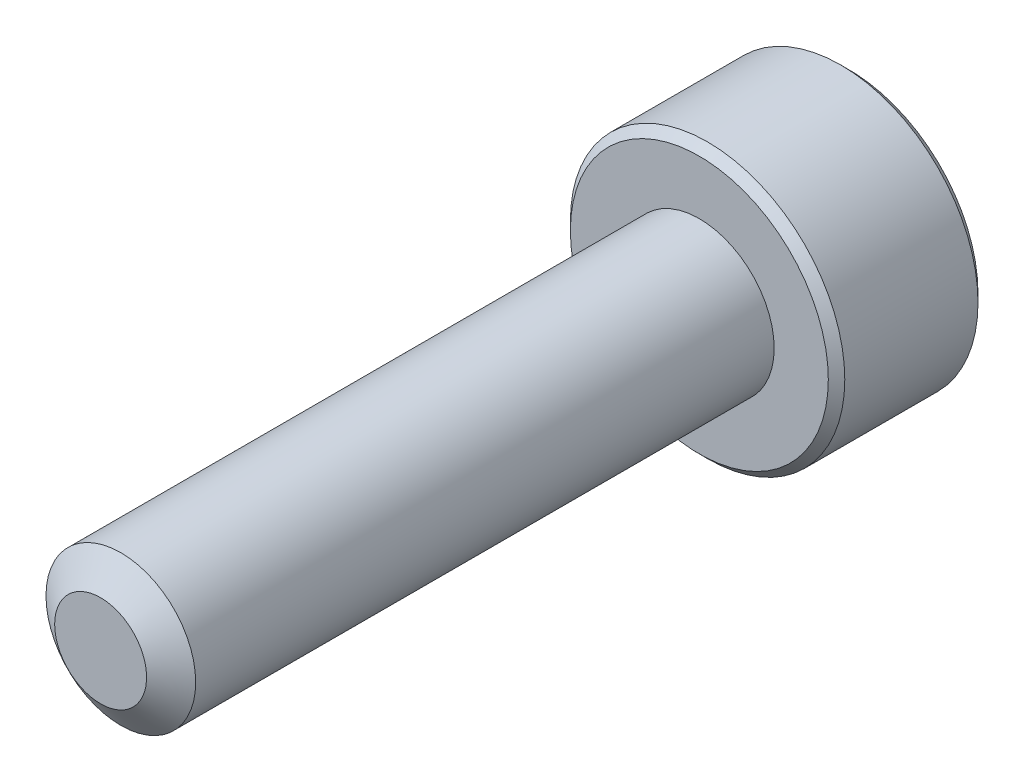
ISO-10303-21;
HEADER;
FILE_DESCRIPTION(('STEP AP214'),'2;1');
FILE_NAME('part.step','',(''),(''),'','','');
FILE_SCHEMA(('AUTOMOTIVE_DESIGN { 1 0 10303 214 1 1 1 1 }'));
ENDSEC;
DATA;
#1=APPLICATION_CONTEXT('core data for automotive mechanical design processes');
#2=APPLICATION_PROTOCOL_DEFINITION('international standard','automotive_design',2000,#1);
#3=PRODUCT_CONTEXT('',#1,'mechanical');
#4=PRODUCT('Part','Part','',(#3));
#5=PRODUCT_RELATED_PRODUCT_CATEGORY('part','',(#4));
#6=PRODUCT_DEFINITION_FORMATION('','',#4);
#7=PRODUCT_DEFINITION_CONTEXT('part definition',#1,'design');
#8=PRODUCT_DEFINITION('design','',#6,#7);
#9=PRODUCT_DEFINITION_SHAPE('','',#8);
#10=(LENGTH_UNIT() NAMED_UNIT(*) SI_UNIT(.MILLI.,.METRE.));
#11=(NAMED_UNIT(*) PLANE_ANGLE_UNIT() SI_UNIT($,.RADIAN.));
#12=(NAMED_UNIT(*) SI_UNIT($,.STERADIAN.) SOLID_ANGLE_UNIT());
#13=UNCERTAINTY_MEASURE_WITH_UNIT(LENGTH_MEASURE(1.E-05),#10,'distance_accuracy_value','');
#14=(GEOMETRIC_REPRESENTATION_CONTEXT(3) GLOBAL_UNCERTAINTY_ASSIGNED_CONTEXT((#13)) GLOBAL_UNIT_ASSIGNED_CONTEXT((#10,
#11,#12)) REPRESENTATION_CONTEXT('',''));
#15=CARTESIAN_POINT('',(0.,0.,0.));
#16=DIRECTION('',(0.,0.,1.));
#17=DIRECTION('',(1.,0.,0.));
#18=AXIS2_PLACEMENT_3D('',#15,#16,#17);
#19=CARTESIAN_POINT('',(0.,-1.44337567297406,-13.125));
#20=DIRECTION('',(-0.5,-0.866025403784439,0.));
#21=DIRECTION('',(0.866025403784439,-0.5,0.));
#22=AXIS2_PLACEMENT_3D('',#19,#20,#21);
#23=PLANE('',#22);
#24=CARTESIAN_POINT('',(-1.24999999999627,-0.72168783648918,-14.999999999981));
#25=CARTESIAN_POINT('',(-1.20703689149248,-0.746492598749065,-14.9752190396993));
#26=CARTESIAN_POINT('',(-1.16335543595108,-0.771712098864492,-14.9518937494442));
#27=CARTESIAN_POINT('',(-1.07428446543387,-0.823137247669584,-14.9091861388918));
#28=CARTESIAN_POINT('',(-1.02888648443279,-0.849347784221223,-14.8898275733312));
#29=CARTESIAN_POINT('',(-0.937343688520416,-0.902200042083602,-14.8566662158854));
#30=CARTESIAN_POINT('',(-0.891222174140268,-0.928828310826413,-14.842780096756));
#31=CARTESIAN_POINT('',(-0.797964038890614,-0.982670920316923,-14.8213859017727));
#32=CARTESIAN_POINT('',(-0.750830264933155,-1.00988361739919,-14.8138618618945));
#33=CARTESIAN_POINT('',(-0.669590913521566,-1.05678717880546,-14.8070728277693));
#34=CARTESIAN_POINT('',(-0.63559017798413,-1.07641751262064,-14.8060681886278));
#35=CARTESIAN_POINT('',(-0.567648554675158,-1.11564362712726,-14.8077634951943));
#36=CARTESIAN_POINT('',(-0.533707681781919,-1.1352393992287,-14.8104642592347));
#37=CARTESIAN_POINT('',(-0.466153619735436,-1.17424175513609,-14.8194142483181));
#38=CARTESIAN_POINT('',(-0.432540764897116,-1.19364814592522,-14.8256667730304));
#39=CARTESIAN_POINT('',(-0.365876260757414,-1.23213691533567,-14.8413835392187));
#40=CARTESIAN_POINT('',(-0.332824858668239,-1.25121915122895,-14.8508491588316));
#41=CARTESIAN_POINT('',(-0.248213569936096,-1.30006950155494,-14.878928331553));
#42=CARTESIAN_POINT('',(-0.19718612443264,-1.32953021095242,-14.8996493450363));
#43=CARTESIAN_POINT('',(-0.0971276056236895,-1.38729902372148,-14.9463235057915));
#44=CARTESIAN_POINT('',(-0.048090642540453,-1.41561052755783,-14.9722596212031));
#45=CARTESIAN_POINT('',(-3.72234882122443E-12,-1.44337567297191,-14.999999999981));
#46=B_SPLINE_CURVE_WITH_KNOTS('',3,(#24,#25,#26,#27,#28,#29,#30,#31,#32,#33,#34,#35,#36,#37,#38,
#39,#40,#41,#42,#43,#44,#45),.UNSPECIFIED.,.F.,.F.,(4,2,2,2,2,2,2,2,2,2,4),(0.,
0.166478683224832,0.333926926830781,0.498716658515402,0.663091654624535,0.780745575556478,
0.898425484349478,1.01621489976821,1.13405490052235,1.32111591640894,1.50757565757659),.UNSPECIFIED.);
#47=CARTESIAN_POINT('',(-1.24999999995354,-0.721687836511705,-14.9999999999553));
#48=VERTEX_POINT('',#47);
#49=CARTESIAN_POINT('',(4.46050730419981E-11,-1.44337567294616,-14.9999999999553));
#50=VERTEX_POINT('',#49);
#51=EDGE_CURVE('E21',#48,#50,#46,.T.);
#52=ORIENTED_EDGE('',*,*,#51,.F.);
#53=DIRECTION('',(0.,0.,1.));
#54=VECTOR('',#53,1.);
#55=CARTESIAN_POINT('',(-1.25,-0.721687836487032,-13.125));
#56=LINE('',#55,#54);
#57=CARTESIAN_POINT('',(-1.25,-0.721687836487031,-13.125));
#58=VERTEX_POINT('',#57);
#59=EDGE_CURVE('E104',#48,#58,#56,.T.);
#60=ORIENTED_EDGE('',*,*,#59,.T.);
#61=DIRECTION('',(0.866025403784439,-0.5,0.));
#62=VECTOR('',#61,1.);
#63=CARTESIAN_POINT('',(0.,-1.44337567297406,-13.125));
#64=LINE('',#63,#62);
#65=CARTESIAN_POINT('',(0.,-1.44337567297406,-13.125));
#66=VERTEX_POINT('',#65);
#67=EDGE_CURVE('E77',#66,#58,#64,.F.);
#68=ORIENTED_EDGE('',*,*,#67,.F.);
#69=DIRECTION('',(0.,0.,1.));
#70=VECTOR('',#69,1.);
#71=CARTESIAN_POINT('',(0.,-1.44337567297406,-13.125));
#72=LINE('',#71,#70);
#73=EDGE_CURVE('E76',#66,#50,#72,.F.);
#74=ORIENTED_EDGE('',*,*,#73,.T.);
#75=EDGE_LOOP('',(#52,#60,#68,#74));
#76=FACE_BOUND('',#75,.T.);
#77=ADVANCED_FACE('F17',(#76),#23,.F.);
#78=CARTESIAN_POINT('',(1.25,-0.721687836487033,-13.125));
#79=DIRECTION('',(0.5,-0.866025403784439,0.));
#80=DIRECTION('',(0.866025403784439,0.5,0.));
#81=AXIS2_PLACEMENT_3D('',#78,#79,#80);
#82=PLANE('',#81);
#83=CARTESIAN_POINT('',(3.7261256635616E-12,-1.44337567297191,-14.999999999981));
#84=CARTESIAN_POINT('',(0.0429631085075139,-1.41857091071203,-14.9752190396993));
#85=CARTESIAN_POINT('',(0.0866445640489222,-1.3933514105966,-14.9518937494442));
#86=CARTESIAN_POINT('',(0.175715534566132,-1.34192626179151,-14.9091861388918));
#87=CARTESIAN_POINT('',(0.221113515567212,-1.31571572523987,-14.8898275733312));
#88=CARTESIAN_POINT('',(0.312656311479583,-1.26286346737749,-14.8566662158855));
#89=CARTESIAN_POINT('',(0.35877782585973,-1.23623519863468,-14.842780096756));
#90=CARTESIAN_POINT('',(0.452035961109383,-1.18239258914417,-14.8213859017727));
#91=CARTESIAN_POINT('',(0.499169735066843,-1.15517989206191,-14.8138618618945));
#92=CARTESIAN_POINT('',(0.580409086478432,-1.10827633065564,-14.8070728277693));
#93=CARTESIAN_POINT('',(0.614409822015868,-1.08864599684045,-14.8060681886278));
#94=CARTESIAN_POINT('',(0.682351445324839,-1.04941988233384,-14.8077634951944));
#95=CARTESIAN_POINT('',(0.716292318218079,-1.0298241102324,-14.8104642592347));
#96=CARTESIAN_POINT('',(0.783846380264562,-0.990821754325007,-14.8194142483181));
#97=CARTESIAN_POINT('',(0.817459235102882,-0.971415363535871,-14.8256667730304));
#98=CARTESIAN_POINT('',(0.884123739242584,-0.932926594125421,-14.8413835392187));
#99=CARTESIAN_POINT('',(0.917175141331759,-0.913844358232141,-14.8508491588316));
#100=CARTESIAN_POINT('',(1.0017864300639,-0.864994007906157,-14.8789283315531));
#101=CARTESIAN_POINT('',(1.05281387556736,-0.835533298508678,-14.8996493450363));
#102=CARTESIAN_POINT('',(1.15287239437631,-0.777764485739615,-14.9463235057915));
#103=CARTESIAN_POINT('',(1.20190935745954,-0.749452981903267,-14.9722596212031));
#104=CARTESIAN_POINT('',(1.24999999999627,-0.721687836489184,-14.999999999981));
#105=B_SPLINE_CURVE_WITH_KNOTS('',3,(#83,#84,#85,#86,#87,#88,#89,#90,#91,#92,#93,#94,#95,#96,
#97,#98,#99,#100,#101,#102,#103,#104),.UNSPECIFIED.,.F.,.F.,(4,2,2,2,2,2,2,2,2,2,4),(0.,
0.166478683224831,0.333926926830779,0.4987166585154,0.663091654624533,0.780745575556475,
0.898425484349476,1.01621489976821,1.13405490052235,1.32111591640894,1.50757565757658),.UNSPECIFIED.);
#106=CARTESIAN_POINT('',(1.24999999999814,-0.721687836434454,-14.9999999999553));
#107=VERTEX_POINT('',#106);
#108=EDGE_CURVE('E84',#50,#107,#105,.T.);
#109=ORIENTED_EDGE('',*,*,#108,.F.);
#110=ORIENTED_EDGE('',*,*,#73,.F.);
#111=DIRECTION('',(-0.86602540378444,-0.499999999999997,0.));
#112=VECTOR('',#111,1.);
#113=CARTESIAN_POINT('',(1.25,-0.721687836487033,-13.125));
#114=LINE('',#113,#112);
#115=CARTESIAN_POINT('',(1.25,-0.721687836487033,-13.125));
#116=VERTEX_POINT('',#115);
#117=EDGE_CURVE('E272',#116,#66,#114,.T.);
#118=ORIENTED_EDGE('',*,*,#117,.F.);
#119=DIRECTION('',(0.,0.,-1.));
#120=VECTOR('',#119,1.);
#121=CARTESIAN_POINT('',(1.25,-0.721687836487033,-13.125));
#122=LINE('',#121,#120);
#123=EDGE_CURVE('E103',#116,#107,#122,.T.);
#124=ORIENTED_EDGE('',*,*,#123,.T.);
#125=EDGE_LOOP('',(#109,#110,#118,#124));
#126=FACE_BOUND('',#125,.T.);
#127=ADVANCED_FACE('F101',(#126),#82,.F.);
#128=CARTESIAN_POINT('',(-1.25,-0.721687836487032,-13.125));
#129=DIRECTION('',(-1.,0.,0.));
#130=DIRECTION('',(0.,-1.,0.));
#131=AXIS2_PLACEMENT_3D('',#128,#129,#130);
#132=PLANE('',#131);
#133=CARTESIAN_POINT('',(-1.25,0.72168783648273,-14.999999999981));
#134=CARTESIAN_POINT('',(-1.25,0.672078311962959,-14.9752190396993));
#135=CARTESIAN_POINT('',(-1.25,0.621639311732106,-14.9518937494442));
#136=CARTESIAN_POINT('',(-1.25,0.518789014121921,-14.9091861388918));
#137=CARTESIAN_POINT('',(-1.25,0.466367941018643,-14.8898275733312));
#138=CARTESIAN_POINT('',(-1.25,0.360663425293887,-14.8566662158854));
#139=CARTESIAN_POINT('',(-1.25,0.307406887808264,-14.842780096756));
#140=CARTESIAN_POINT('',(-1.25,0.199721668827244,-14.8213859017727));
#141=CARTESIAN_POINT('',(-1.25,0.145296274662719,-14.8138618618945));
#142=CARTESIAN_POINT('',(-1.25,0.0514891518501771,-14.8070728277693));
#143=CARTESIAN_POINT('',(-1.25,0.0122284842198091,-14.8060681886278));
#144=CARTESIAN_POINT('',(-1.25,-0.066223744793421,-14.8077634951944));
#145=CARTESIAN_POINT('',(-1.25,-0.105415288996306,-14.8104642592347));
#146=CARTESIAN_POINT('',(-1.25,-0.183420000811086,-14.8194142483181));
#147=CARTESIAN_POINT('',(-1.25,-0.222232782389357,-14.8256667730304));
#148=CARTESIAN_POINT('',(-1.25,-0.299210321210257,-14.8413835392187));
#149=CARTESIAN_POINT('',(-1.25,-0.337374792996817,-14.8508491588316));
#150=CARTESIAN_POINT('',(-1.25,-0.435075493648785,-14.8789283315531));
#151=CARTESIAN_POINT('',(-1.25,-0.493996912443743,-14.8996493450363));
#152=CARTESIAN_POINT('',(-1.25,-0.609534537981867,-14.9463235057915));
#153=CARTESIAN_POINT('',(-1.25,-0.666157545654563,-14.9722596212031));
#154=CARTESIAN_POINT('',(-1.25,-0.721687836482729,-14.999999999981));
#155=B_SPLINE_CURVE_WITH_KNOTS('',3,(#133,#134,#135,#136,#137,#138,#139,#140,#141,#142,#143,
#144,#145,#146,#147,#148,#149,#150,#151,#152,#153,#154),.UNSPECIFIED.,.F.,.F.,(4,2,2,2,2,2,2,2,
2,2,4),(0.,0.166478683224831,0.33392692683078,0.4987166585154,0.663091654624533,
0.780745575556475,0.898425484349476,1.01621489976821,1.13405490052235,1.32111591640894,
1.50757565757658),.UNSPECIFIED.);
#156=CARTESIAN_POINT('',(-1.24999999999814,0.721687836434454,-14.9999999999553));
#157=VERTEX_POINT('',#156);
#158=EDGE_CURVE('E61',#157,#48,#155,.T.);
#159=ORIENTED_EDGE('',*,*,#158,.F.);
#160=DIRECTION('',(0.,0.,1.));
#161=VECTOR('',#160,1.);
#162=CARTESIAN_POINT('',(-1.25,0.721687836487032,-13.125));
#163=LINE('',#162,#161);
#164=CARTESIAN_POINT('',(-1.25,0.721687836487032,-13.125));
#165=VERTEX_POINT('',#164);
#166=EDGE_CURVE('E249',#157,#165,#163,.T.);
#167=ORIENTED_EDGE('',*,*,#166,.T.);
#168=DIRECTION('',(0.,1.,0.));
#169=VECTOR('',#168,1.);
#170=CARTESIAN_POINT('',(-1.25,2.1650635094611,-13.125));
#171=LINE('',#170,#169);
#172=EDGE_CURVE('E268',#58,#165,#171,.T.);
#173=ORIENTED_EDGE('',*,*,#172,.F.);
#174=ORIENTED_EDGE('',*,*,#59,.F.);
#175=EDGE_LOOP('',(#159,#167,#173,#174));
#176=FACE_BOUND('',#175,.T.);
#177=ADVANCED_FACE('F122',(#176),#132,.F.);
#178=CARTESIAN_POINT('',(1.25,2.1650635094611,-13.125));
#179=DIRECTION('',(0.,0.,-1.));
#180=DIRECTION('',(-1.,0.,0.));
#181=AXIS2_PLACEMENT_3D('',#178,#179,#180);
#182=PLANE('',#181);
#183=ORIENTED_EDGE('',*,*,#67,.T.);
#184=ORIENTED_EDGE('',*,*,#172,.T.);
#185=DIRECTION('',(-0.866025403784439,-0.5,0.));
#186=VECTOR('',#185,1.);
#187=CARTESIAN_POINT('',(-1.25,0.721687836487032,-13.125));
#188=LINE('',#187,#186);
#189=CARTESIAN_POINT('',(0.,1.44337567297406,-13.125));
#190=VERTEX_POINT('',#189);
#191=EDGE_CURVE('E144',#165,#190,#188,.F.);
#192=ORIENTED_EDGE('',*,*,#191,.T.);
#193=DIRECTION('',(-0.866025403784439,0.5,0.));
#194=VECTOR('',#193,1.);
#195=CARTESIAN_POINT('',(0.,1.44337567297406,-13.125));
#196=LINE('',#195,#194);
#197=CARTESIAN_POINT('',(1.25,0.721687836487029,-13.125));
#198=VERTEX_POINT('',#197);
#199=EDGE_CURVE('E246',#190,#198,#196,.F.);
#200=ORIENTED_EDGE('',*,*,#199,.T.);
#201=DIRECTION('',(0.,1.,0.));
#202=VECTOR('',#201,1.);
#203=CARTESIAN_POINT('',(1.25,0.721687836487032,-13.125));
#204=LINE('',#203,#202);
#205=EDGE_CURVE('E263',#198,#116,#204,.F.);
#206=ORIENTED_EDGE('',*,*,#205,.T.);
#207=ORIENTED_EDGE('',*,*,#117,.T.);
#208=EDGE_LOOP('',(#183,#184,#192,#200,#206,#207));
#209=FACE_BOUND('',#208,.T.);
#210=ADVANCED_FACE('F126',(#209),#182,.T.);
#211=CARTESIAN_POINT('',(1.25,0.721687836487032,-13.125));
#212=DIRECTION('',(1.,0.,0.));
#213=DIRECTION('',(0.,0.,-1.));
#214=AXIS2_PLACEMENT_3D('',#211,#212,#213);
#215=PLANE('',#214);
#216=CARTESIAN_POINT('',(1.25,-0.72168783648273,-14.999999999981));
#217=CARTESIAN_POINT('',(1.25,-0.672078311962964,-14.9752190396993));
#218=CARTESIAN_POINT('',(1.25,-0.621639311732115,-14.9518937494442));
#219=CARTESIAN_POINT('',(1.25,-0.51878901412194,-14.9091861388919));
#220=CARTESIAN_POINT('',(1.25,-0.466367941018668,-14.8898275733312));
#221=CARTESIAN_POINT('',(1.25,-0.360663425293912,-14.8566662158855));
#222=CARTESIAN_POINT('',(1.25,-0.307406887808284,-14.842780096756));
#223=CARTESIAN_POINT('',(1.25,-0.199721668827255,-14.8213859017727));
#224=CARTESIAN_POINT('',(1.25,-0.145296274662725,-14.8138618618945));
#225=CARTESIAN_POINT('',(1.25,-0.0514891518501756,-14.8070728277693));
#226=CARTESIAN_POINT('',(1.25,-0.0122284842198057,-14.8060681886278));
#227=CARTESIAN_POINT('',(1.25,0.066223744793428,-14.8077634951944));
#228=CARTESIAN_POINT('',(1.25,0.105415288996315,-14.8104642592347));
#229=CARTESIAN_POINT('',(1.25,0.183420000811095,-14.8194142483181));
#230=CARTESIAN_POINT('',(1.25,0.222232782389364,-14.8256667730304));
#231=CARTESIAN_POINT('',(1.25,0.299210321210261,-14.8413835392187));
#232=CARTESIAN_POINT('',(1.25,0.337374792996818,-14.8508491588316));
#233=CARTESIAN_POINT('',(1.25,0.435075493647794,-14.8789283315528));
#234=CARTESIAN_POINT('',(1.25,0.493996912441795,-14.8996493450356));
#235=CARTESIAN_POINT('',(1.25,0.60953453797808,-14.9463235057899));
#236=CARTESIAN_POINT('',(1.25,0.666157545649894,-14.9722596212009));
#237=CARTESIAN_POINT('',(1.25,0.721687836477213,-14.9999999999783));
#238=B_SPLINE_CURVE_WITH_KNOTS('',3,(#216,#217,#218,#219,#220,#221,#222,#223,#224,#225,#226,
#227,#228,#229,#230,#231,#232,#233,#234,#235,#236,#237),.UNSPECIFIED.,.F.,.F.,(4,2,2,2,2,2,2,2,
2,2,4),(0.,0.166478683224816,0.333926926830748,0.498716658515384,0.663091654624533,
0.78074557555648,0.898425484349487,1.01621489976822,1.13405490052235,1.32111591640585,
1.50757565757042),.UNSPECIFIED.);
#239=CARTESIAN_POINT('',(1.24999999997677,0.721687836473617,-14.9999999999563));
#240=VERTEX_POINT('',#239);
#241=EDGE_CURVE('E40',#107,#240,#238,.T.);
#242=ORIENTED_EDGE('',*,*,#241,.F.);
#243=ORIENTED_EDGE('',*,*,#123,.F.);
#244=ORIENTED_EDGE('',*,*,#205,.F.);
#245=DIRECTION('',(0.,0.,1.));
#246=VECTOR('',#245,1.);
#247=CARTESIAN_POINT('',(1.25,0.721687836487029,-13.125));
#248=LINE('',#247,#246);
#249=EDGE_CURVE('E242',#198,#240,#248,.F.);
#250=ORIENTED_EDGE('',*,*,#249,.T.);
#251=EDGE_LOOP('',(#242,#243,#244,#250));
#252=FACE_BOUND('',#251,.T.);
#253=ADVANCED_FACE('F130',(#252),#215,.F.);
#254=CARTESIAN_POINT('',(-1.25,0.721687836487032,-13.125));
#255=DIRECTION('',(-0.5,0.866025403784439,0.));
#256=DIRECTION('',(-0.866025403784439,-0.5,0.));
#257=AXIS2_PLACEMENT_3D('',#254,#255,#256);
#258=PLANE('',#257);
#259=CARTESIAN_POINT('',(-8.50305368319054E-12,1.44337567296915,-14.9999999999783));
#260=CARTESIAN_POINT('',(-0.042963108512007,1.41857091070943,-14.9752190396968));
#261=CARTESIAN_POINT('',(-0.0866445640531236,1.39335141059418,-14.9518937494421));
#262=CARTESIAN_POINT('',(-0.175715534569723,1.34192626178944,-14.9091861388903));
#263=CARTESIAN_POINT('',(-0.221113515570482,1.31571572523798,-14.8898275733298));
#264=CARTESIAN_POINT('',(-0.312656311482196,1.26286346737598,-14.8566662158846));
#265=CARTESIAN_POINT('',(-0.358777825862007,1.23623519863337,-14.8427800967554));
#266=CARTESIAN_POINT('',(-0.452035961110966,1.18239258914326,-14.8213859017724));
#267=CARTESIAN_POINT('',(-0.499169735068068,1.1551798920612,-14.8138618618944));
#268=CARTESIAN_POINT('',(-0.580409086479279,1.10827633065515,-14.8070728277692));
#269=CARTESIAN_POINT('',(-0.614409822016699,1.08864599683997,-14.8060681886278));
#270=CARTESIAN_POINT('',(-0.682351445325638,1.04941988233338,-14.8077634951944));
#271=CARTESIAN_POINT('',(-0.716292318218859,1.02982411023194,-14.8104642592348));
#272=CARTESIAN_POINT('',(-0.783846380265307,0.990821754324575,-14.8194142483182));
#273=CARTESIAN_POINT('',(-0.81745923510361,0.97141536353545,-14.8256667730305));
#274=CARTESIAN_POINT('',(-0.884123739243276,0.93292659412502,-14.8413835392189));
#275=CARTESIAN_POINT('',(-0.917175141332433,0.913844358231751,-14.8508491588318));
#276=CARTESIAN_POINT('',(-1.00178643006444,0.864994007905843,-14.8789283315533));
#277=CARTESIAN_POINT('',(-1.05281387556779,0.835533298508428,-14.8996493450365));
#278=CARTESIAN_POINT('',(-1.15287239437652,0.777764485739493,-14.9463235057916));
#279=CARTESIAN_POINT('',(-1.20190935745965,0.749452981903207,-14.9722596212031));
#280=CARTESIAN_POINT('',(-1.24999999999627,0.721687836489183,-14.999999999981));
#281=B_SPLINE_CURVE_WITH_KNOTS('',3,(#259,#260,#261,#262,#263,#264,#265,#266,#267,#268,#269,
#270,#271,#272,#273,#274,#275,#276,#277,#278,#279,#280),.UNSPECIFIED.,.F.,.F.,(4,2,2,2,2,2,2,2,
2,2,4),(0.,0.16647868322354,0.333926926828167,0.498716658511505,0.663091654619367,
0.780745575551253,0.898425484344198,1.01621489976289,1.13405490051697,1.32111591640318,
1.50757565757042),.UNSPECIFIED.);
#282=CARTESIAN_POINT('',(4.22105840629216E-11,1.44337567294478,-14.9999999999539));
#283=VERTEX_POINT('',#282);
#284=EDGE_CURVE('E145',#283,#157,#281,.T.);
#285=ORIENTED_EDGE('',*,*,#284,.F.);
#286=DIRECTION('',(0.,0.,1.));
#287=VECTOR('',#286,1.);
#288=CARTESIAN_POINT('',(0.,1.44337567297406,-13.125));
#289=LINE('',#288,#287);
#290=EDGE_CURVE('E170',#283,#190,#289,.T.);
#291=ORIENTED_EDGE('',*,*,#290,.T.);
#292=ORIENTED_EDGE('',*,*,#191,.F.);
#293=ORIENTED_EDGE('',*,*,#166,.F.);
#294=EDGE_LOOP('',(#285,#291,#292,#293));
#295=FACE_BOUND('',#294,.T.);
#296=ADVANCED_FACE('F135',(#295),#258,.F.);
#297=CARTESIAN_POINT('',(0.,1.44337567297406,-13.125));
#298=DIRECTION('',(0.5,0.866025403784439,0.));
#299=DIRECTION('',(-0.866025403784439,0.5,0.));
#300=AXIS2_PLACEMENT_3D('',#297,#298,#299);
#301=PLANE('',#300);
#302=CARTESIAN_POINT('',(8.50024270183818E-12,1.44337567296915,-14.9999999999783));
#303=CARTESIAN_POINT('',(0.0429631085120007,1.41857091070943,-14.9752190396968));
#304=CARTESIAN_POINT('',(0.0866445640531133,1.39335141059418,-14.9518937494421));
#305=CARTESIAN_POINT('',(0.175715534569704,1.34192626178944,-14.9091861388903));
#306=CARTESIAN_POINT('',(0.221113515570459,1.31571572523799,-14.8898275733299));
#307=CARTESIAN_POINT('',(0.312656311482173,1.26286346737599,-14.8566662158846));
#308=CARTESIAN_POINT('',(0.358777825861988,1.23623519863337,-14.8427800967554));
#309=CARTESIAN_POINT('',(0.452035961110956,1.18239258914326,-14.8213859017724));
#310=CARTESIAN_POINT('',(0.499169735068062,1.1551798920612,-14.8138618618944));
#311=CARTESIAN_POINT('',(0.580409086479279,1.10827633065514,-14.8070728277692));
#312=CARTESIAN_POINT('',(0.6144098220167,1.08864599683997,-14.8060681886278));
#313=CARTESIAN_POINT('',(0.682351445325642,1.04941988233337,-14.8077634951944));
#314=CARTESIAN_POINT('',(0.716292318218865,1.02982411023194,-14.8104642592348));
#315=CARTESIAN_POINT('',(0.783846380265313,0.990821754324568,-14.8194142483182));
#316=CARTESIAN_POINT('',(0.817459235103614,0.971415363535443,-14.8256667730305));
#317=CARTESIAN_POINT('',(0.884123739243277,0.932926594125016,-14.8413835392189));
#318=CARTESIAN_POINT('',(0.917175141332432,0.913844358231748,-14.8508491588318));
#319=CARTESIAN_POINT('',(1.00178643006358,0.864994007906336,-14.878928331553));
#320=CARTESIAN_POINT('',(1.0528138755661,0.8355332985094,-14.8996493450358));
#321=CARTESIAN_POINT('',(1.15287239437324,0.777764485741383,-14.94632350579));
#322=CARTESIAN_POINT('',(1.2019093574556,0.749452981905538,-14.972259621201));
#323=CARTESIAN_POINT('',(1.2499999999915,0.721687836491938,-14.9999999999783));
#324=B_SPLINE_CURVE_WITH_KNOTS('',3,(#302,#303,#304,#305,#306,#307,#308,#309,#310,#311,#312,
#313,#314,#315,#316,#317,#318,#319,#320,#321,#322,#323),.UNSPECIFIED.,.F.,.F.,(4,2,2,2,2,2,2,2,
2,2,4),(0.,0.166478683223525,0.333926926828138,0.498716658511492,0.663091654619369,
0.78074557555126,0.898425484344211,1.01621489976289,1.13405490051697,1.32111591640009,
1.50757565756426),.UNSPECIFIED.);
#325=EDGE_CURVE('E162',#283,#240,#324,.T.);
#326=ORIENTED_EDGE('',*,*,#325,.T.);
#327=ORIENTED_EDGE('',*,*,#249,.F.);
#328=ORIENTED_EDGE('',*,*,#199,.F.);
#329=ORIENTED_EDGE('',*,*,#290,.F.);
#330=EDGE_LOOP('',(#326,#327,#328,#329));
#331=FACE_BOUND('',#330,.T.);
#332=ADVANCED_FACE('F172',(#331),#301,.F.);
#333=CARTESIAN_POINT('',(0.,0.,-14.9999999998727));
#334=DIRECTION('',(0.,0.,-1.));
#335=DIRECTION('',(-1.,0.,0.));
#336=AXIS2_PLACEMENT_3D('',#333,#334,#335);
#337=CONICAL_SURFACE('',#336,1.44337567286357,0.785398163397448);
#338=ORIENTED_EDGE('',*,*,#284,.T.);
#339=CARTESIAN_POINT('',(0.,0.,-14.9999999999295));
#340=DIRECTION('',(0.,0.,-1.));
#341=DIRECTION('',(-1.,0.,0.));
#342=AXIS2_PLACEMENT_3D('',#339,#340,#341);
#343=CIRCLE('',#342,1.44337567292041);
#344=EDGE_CURVE('E169',#283,#157,#343,.F.);
#345=ORIENTED_EDGE('',*,*,#344,.F.);
#346=EDGE_LOOP('',(#338,#345));
#347=FACE_BOUND('',#346,.T.);
#348=ADVANCED_FACE('F175',(#347),#337,.F.);
#349=CARTESIAN_POINT('',(0.,0.,-14.9999999998727));
#350=DIRECTION('',(0.,0.,-1.));
#351=DIRECTION('',(-1.,0.,0.));
#352=AXIS2_PLACEMENT_3D('',#349,#350,#351);
#353=CONICAL_SURFACE('',#352,1.44337567286357,0.785398163397448);
#354=CARTESIAN_POINT('',(0.,0.,-14.9999999999295));
#355=DIRECTION('',(0.,0.,-1.));
#356=DIRECTION('',(-1.,0.,0.));
#357=AXIS2_PLACEMENT_3D('',#354,#355,#356);
#358=CIRCLE('',#357,1.44337567292041);
#359=EDGE_CURVE('E94',#157,#48,#358,.F.);
#360=ORIENTED_EDGE('',*,*,#359,.F.);
#361=ORIENTED_EDGE('',*,*,#158,.T.);
#362=EDGE_LOOP('',(#360,#361));
#363=FACE_BOUND('',#362,.T.);
#364=ADVANCED_FACE('F179',(#363),#353,.F.);
#365=CARTESIAN_POINT('',(0.,0.,-14.9999999998727));
#366=DIRECTION('',(0.,0.,-1.));
#367=DIRECTION('',(-1.,0.,0.));
#368=AXIS2_PLACEMENT_3D('',#365,#366,#367);
#369=CONICAL_SURFACE('',#368,1.44337567286357,0.785398163397448);
#370=ORIENTED_EDGE('',*,*,#51,.T.);
#371=CARTESIAN_POINT('',(0.,0.,-14.9999999999295));
#372=DIRECTION('',(0.,0.,-1.));
#373=DIRECTION('',(-1.,0.,0.));
#374=AXIS2_PLACEMENT_3D('',#371,#372,#373);
#375=CIRCLE('',#374,1.44337567292041);
#376=EDGE_CURVE('E72',#48,#50,#375,.F.);
#377=ORIENTED_EDGE('',*,*,#376,.F.);
#378=EDGE_LOOP('',(#370,#377));
#379=FACE_BOUND('',#378,.T.);
#380=ADVANCED_FACE('F70',(#379),#369,.F.);
#381=CARTESIAN_POINT('',(0.,0.,-14.9999999998727));
#382=DIRECTION('',(0.,0.,-1.));
#383=DIRECTION('',(-1.,0.,0.));
#384=AXIS2_PLACEMENT_3D('',#381,#382,#383);
#385=CONICAL_SURFACE('',#384,1.44337567286357,0.785398163397448);
#386=ORIENTED_EDGE('',*,*,#108,.T.);
#387=CARTESIAN_POINT('',(0.,0.,-14.9999999999295));
#388=DIRECTION('',(0.,0.,-1.));
#389=DIRECTION('',(-1.,0.,0.));
#390=AXIS2_PLACEMENT_3D('',#387,#388,#389);
#391=CIRCLE('',#390,1.44337567292041);
#392=EDGE_CURVE('E92',#50,#107,#391,.F.);
#393=ORIENTED_EDGE('',*,*,#392,.F.);
#394=EDGE_LOOP('',(#386,#393));
#395=FACE_BOUND('',#394,.T.);
#396=ADVANCED_FACE('F97',(#395),#385,.F.);
#397=CARTESIAN_POINT('',(0.,0.,-14.9999999998727));
#398=DIRECTION('',(0.,0.,-1.));
#399=DIRECTION('',(-1.,0.,0.));
#400=AXIS2_PLACEMENT_3D('',#397,#398,#399);
#401=CONICAL_SURFACE('',#400,1.44337567286357,0.785398163397448);
#402=ORIENTED_EDGE('',*,*,#241,.T.);
#403=CARTESIAN_POINT('',(0.,0.,-14.9999999999295));
#404=DIRECTION('',(0.,0.,-1.));
#405=DIRECTION('',(-1.,0.,0.));
#406=AXIS2_PLACEMENT_3D('',#403,#404,#405);
#407=CIRCLE('',#406,1.44337567292041);
#408=EDGE_CURVE('E99',#107,#240,#407,.F.);
#409=ORIENTED_EDGE('',*,*,#408,.F.);
#410=EDGE_LOOP('',(#402,#409));
#411=FACE_BOUND('',#410,.T.);
#412=ADVANCED_FACE('F152',(#411),#401,.F.);
#413=CARTESIAN_POINT('',(0.,0.,-14.9999999998727));
#414=DIRECTION('',(0.,0.,-1.));
#415=DIRECTION('',(-1.,0.,0.));
#416=AXIS2_PLACEMENT_3D('',#413,#414,#415);
#417=CONICAL_SURFACE('',#416,1.44337567286357,0.785398163397448);
#418=ORIENTED_EDGE('',*,*,#325,.F.);
#419=CARTESIAN_POINT('',(0.,0.,-14.9999999999295));
#420=DIRECTION('',(0.,0.,-1.));
#421=DIRECTION('',(-1.,0.,0.));
#422=AXIS2_PLACEMENT_3D('',#419,#420,#421);
#423=CIRCLE('',#422,1.44337567292041);
#424=EDGE_CURVE('E234',#240,#283,#423,.F.);
#425=ORIENTED_EDGE('',*,*,#424,.F.);
#426=EDGE_LOOP('',(#418,#425));
#427=FACE_BOUND('',#426,.T.);
#428=ADVANCED_FACE('F156',(#427),#417,.F.);
#429=CARTESIAN_POINT('',(0.,0.,-15.));
#430=DIRECTION('',(0.,0.,-1.));
#431=DIRECTION('',(-1.,0.,0.));
#432=AXIS2_PLACEMENT_3D('',#429,#430,#431);
#433=PLANE('',#432);
#434=ORIENTED_EDGE('',*,*,#408,.T.);
#435=ORIENTED_EDGE('',*,*,#424,.T.);
#436=ORIENTED_EDGE('',*,*,#344,.T.);
#437=ORIENTED_EDGE('',*,*,#359,.T.);
#438=ORIENTED_EDGE('',*,*,#376,.T.);
#439=ORIENTED_EDGE('',*,*,#392,.T.);
#440=EDGE_LOOP('',(#434,#435,#436,#437,#438,#439));
#441=FACE_BOUND('',#440,.T.);
#442=CARTESIAN_POINT('',(0.,0.,-14.9999999999864));
#443=DIRECTION('',(0.,0.,1.));
#444=DIRECTION('',(1.,0.,0.));
#445=AXIS2_PLACEMENT_3D('',#442,#443,#444);
#446=CIRCLE('',#445,2.5850000000105);
#447=CARTESIAN_POINT('',(2.5850000000105,0.,-14.9999999999864));
#448=VERTEX_POINT('',#447);
#449=EDGE_CURVE('E225',#448,#448,#446,.T.);
#450=ORIENTED_EDGE('',*,*,#449,.F.);
#451=EDGE_LOOP('',(#450));
#452=FACE_BOUND('',#451,.T.);
#453=ADVANCED_FACE('F90',(#441,#452),#433,.T.);
#454=CARTESIAN_POINT('',(0.,0.,-14.8349999998914));
#455=DIRECTION('',(0.,0.,1.));
#456=DIRECTION('',(1.,0.,0.));
#457=AXIS2_PLACEMENT_3D('',#454,#455,#456);
#458=CONICAL_SURFACE('',#457,2.7500000001055,0.785398163397448);
#459=ORIENTED_EDGE('',*,*,#449,.T.);
#460=EDGE_LOOP('',(#459));
#461=FACE_BOUND('',#460,.T.);
#462=CARTESIAN_POINT('',(0.,0.,-14.835));
#463=DIRECTION('',(0.,0.,1.));
#464=DIRECTION('',(1.,0.,0.));
#465=AXIS2_PLACEMENT_3D('',#462,#463,#464);
#466=CIRCLE('',#465,2.75);
#467=CARTESIAN_POINT('',(2.75,0.,-14.835));
#468=VERTEX_POINT('',#467);
#469=EDGE_CURVE('E228',#468,#468,#466,.T.);
#470=ORIENTED_EDGE('',*,*,#469,.F.);
#471=EDGE_LOOP('',(#470));
#472=FACE_BOUND('',#471,.T.);
#473=ADVANCED_FACE('F215',(#461,#472),#458,.T.);
#474=CARTESIAN_POINT('',(0.,0.,-15.));
#475=DIRECTION('',(0.,0.,1.));
#476=DIRECTION('',(1.,0.,0.));
#477=AXIS2_PLACEMENT_3D('',#474,#475,#476);
#478=CYLINDRICAL_SURFACE('',#477,2.75);
#479=ORIENTED_EDGE('',*,*,#469,.T.);
#480=EDGE_LOOP('',(#479));
#481=FACE_BOUND('',#480,.T.);
#482=CARTESIAN_POINT('',(0.,0.,-12.1649999999818));
#483=DIRECTION('',(0.,0.,-1.));
#484=DIRECTION('',(-1.,0.,0.));
#485=AXIS2_PLACEMENT_3D('',#482,#483,#484);
#486=CIRCLE('',#485,2.75000000004866);
#487=CARTESIAN_POINT('',(-2.75000000004866,0.,-12.1649999999818));
#488=VERTEX_POINT('',#487);
#489=EDGE_CURVE('E229',#488,#488,#486,.F.);
#490=ORIENTED_EDGE('',*,*,#489,.F.);
#491=EDGE_LOOP('',(#490));
#492=FACE_BOUND('',#491,.T.);
#493=ADVANCED_FACE('F212',(#481,#492),#478,.T.);
#494=CARTESIAN_POINT('',(0.,0.,0.));
#495=DIRECTION('',(0.,0.,1.));
#496=DIRECTION('',(1.,0.,0.));
#497=AXIS2_PLACEMENT_3D('',#494,#495,#496);
#498=PLANE('',#497);
#499=CARTESIAN_POINT('',(0.,0.,5.6843418860808E-11));
#500=DIRECTION('',(0.,0.,-1.));
#501=DIRECTION('',(-1.,0.,0.));
#502=AXIS2_PLACEMENT_3D('',#499,#500,#501);
#503=CIRCLE('',#502,0.921240473587659);
#504=CARTESIAN_POINT('',(-0.921240473587659,0.,5.6843418860808E-11));
#505=VERTEX_POINT('',#504);
#506=EDGE_CURVE('E232',#505,#505,#503,.T.);
#507=ORIENTED_EDGE('',*,*,#506,.F.);
#508=EDGE_LOOP('',(#507));
#509=FACE_BOUND('',#508,.T.);
#510=ADVANCED_FACE('F208',(#509),#498,.T.);
#511=CARTESIAN_POINT('',(0.,0.,-12.1649999999818));
#512=DIRECTION('',(0.,0.,-1.));
#513=DIRECTION('',(-1.,0.,0.));
#514=AXIS2_PLACEMENT_3D('',#511,#512,#513);
#515=CONICAL_SURFACE('',#514,2.75000000004866,0.785398163569701);
#516=CARTESIAN_POINT('',(0.,0.,-12.0000000000005));
#517=DIRECTION('',(0.,0.,-1.));
#518=DIRECTION('',(-1.,0.,0.));
#519=AXIS2_PLACEMENT_3D('',#516,#517,#518);
#520=CIRCLE('',#519,2.5850000000105);
#521=CARTESIAN_POINT('',(-2.5850000000105,0.,-12.0000000000005));
#522=VERTEX_POINT('',#521);
#523=EDGE_CURVE('E287',#522,#522,#520,.T.);
#524=ORIENTED_EDGE('',*,*,#523,.T.);
#525=EDGE_LOOP('',(#524));
#526=FACE_BOUND('',#525,.T.);
#527=ORIENTED_EDGE('',*,*,#489,.T.);
#528=EDGE_LOOP('',(#527));
#529=FACE_BOUND('',#528,.T.);
#530=ADVANCED_FACE('F204',(#526,#529),#515,.T.);
#531=CARTESIAN_POINT('',(0.,0.,-0.405251783149652));
#532=DIRECTION('',(0.,0.,-1.));
#533=DIRECTION('',(-1.,0.,0.));
#534=AXIS2_PLACEMENT_3D('',#531,#532,#533);
#535=CONICAL_SURFACE('',#534,1.50000000002137,0.959931088612039);
#536=ORIENTED_EDGE('',*,*,#506,.T.);
#537=EDGE_LOOP('',(#536));
#538=FACE_BOUND('',#537,.T.);
#539=CARTESIAN_POINT('',(0.,0.,-0.405251783209378));
#540=DIRECTION('',(0.,0.,1.));
#541=DIRECTION('',(1.,0.,0.));
#542=AXIS2_PLACEMENT_3D('',#539,#540,#541);
#543=CIRCLE('',#542,1.5);
#544=CARTESIAN_POINT('',(1.5,0.,-0.405251783209378));
#545=VERTEX_POINT('',#544);
#546=EDGE_CURVE('E32',#545,#545,#543,.F.);
#547=ORIENTED_EDGE('',*,*,#546,.F.);
#548=EDGE_LOOP('',(#547));
#549=FACE_BOUND('',#548,.T.);
#550=ADVANCED_FACE('F197',(#538,#549),#535,.T.);
#551=CARTESIAN_POINT('',(0.,0.,-12.));
#552=DIRECTION('',(0.,0.,-1.));
#553=DIRECTION('',(-1.,0.,0.));
#554=AXIS2_PLACEMENT_3D('',#551,#552,#553);
#555=PLANE('',#554);
#556=CARTESIAN_POINT('',(0.,0.,-12.));
#557=DIRECTION('',(0.,0.,1.));
#558=DIRECTION('',(1.,0.,0.));
#559=AXIS2_PLACEMENT_3D('',#556,#557,#558);
#560=CIRCLE('',#559,1.5);
#561=CARTESIAN_POINT('',(1.5,0.,-12.));
#562=VERTEX_POINT('',#561);
#563=EDGE_CURVE('E11',#562,#562,#560,.T.);
#564=ORIENTED_EDGE('',*,*,#563,.F.);
#565=EDGE_LOOP('',(#564));
#566=FACE_BOUND('',#565,.T.);
#567=ORIENTED_EDGE('',*,*,#523,.F.);
#568=EDGE_LOOP('',(#567));
#569=FACE_BOUND('',#568,.T.);
#570=ADVANCED_FACE('F191',(#566,#569),#555,.F.);
#571=CARTESIAN_POINT('',(0.,0.,-12.));
#572=DIRECTION('',(0.,0.,1.));
#573=DIRECTION('',(1.,0.,0.));
#574=AXIS2_PLACEMENT_3D('',#571,#572,#573);
#575=CYLINDRICAL_SURFACE('',#574,1.5);
#576=ORIENTED_EDGE('',*,*,#563,.T.);
#577=EDGE_LOOP('',(#576));
#578=FACE_BOUND('',#577,.T.);
#579=ORIENTED_EDGE('',*,*,#546,.T.);
#580=EDGE_LOOP('',(#579));
#581=FACE_BOUND('',#580,.T.);
#582=ADVANCED_FACE('F189',(#578,#581),#575,.T.);
#583=CLOSED_SHELL('',(#77,#127,#177,#210,#253,#296,#332,#348,#364,#380,#396,#412,#428,#453,#473,
#493,#510,#530,#550,#570,#582));
#584=MANIFOLD_SOLID_BREP('B1',#583);
#585=ADVANCED_BREP_SHAPE_REPRESENTATION('',(#18,#584),#14);
#586=SHAPE_DEFINITION_REPRESENTATION(#9,#585);
ENDSEC;
END-ISO-10303-21;
